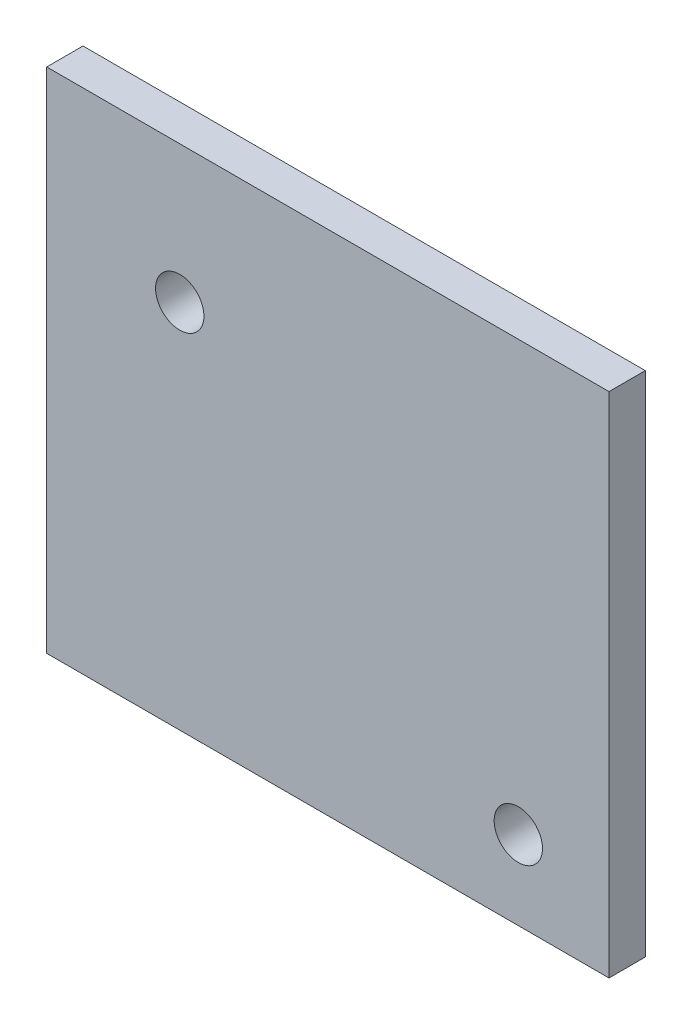
ISO-10303-21;
HEADER;
FILE_DESCRIPTION(('STEP AP214'),'2;1');
FILE_NAME('part.step','',(''),(''),'','','');
FILE_SCHEMA(('AUTOMOTIVE_DESIGN { 1 0 10303 214 1 1 1 1 }'));
ENDSEC;
DATA;
#1=APPLICATION_CONTEXT('core data for automotive mechanical design processes');
#2=APPLICATION_PROTOCOL_DEFINITION('international standard','automotive_design',2000,#1);
#3=PRODUCT_CONTEXT('',#1,'mechanical');
#4=PRODUCT('Part','Part','',(#3));
#5=PRODUCT_RELATED_PRODUCT_CATEGORY('part','',(#4));
#6=PRODUCT_DEFINITION_FORMATION('','',#4);
#7=PRODUCT_DEFINITION_CONTEXT('part definition',#1,'design');
#8=PRODUCT_DEFINITION('design','',#6,#7);
#9=PRODUCT_DEFINITION_SHAPE('','',#8);
#10=(LENGTH_UNIT() NAMED_UNIT(*) SI_UNIT(.MILLI.,.METRE.));
#11=(NAMED_UNIT(*) PLANE_ANGLE_UNIT() SI_UNIT($,.RADIAN.));
#12=(NAMED_UNIT(*) SI_UNIT($,.STERADIAN.) SOLID_ANGLE_UNIT());
#13=UNCERTAINTY_MEASURE_WITH_UNIT(LENGTH_MEASURE(1.E-05),#10,'distance_accuracy_value','');
#14=(GEOMETRIC_REPRESENTATION_CONTEXT(3) GLOBAL_UNCERTAINTY_ASSIGNED_CONTEXT((#13)) GLOBAL_UNIT_ASSIGNED_CONTEXT((#10,
#11,#12)) REPRESENTATION_CONTEXT('',''));
#15=CARTESIAN_POINT('',(0.,0.,0.));
#16=DIRECTION('',(0.,0.,1.));
#17=DIRECTION('',(1.,0.,0.));
#18=AXIS2_PLACEMENT_3D('',#15,#16,#17);
#19=CARTESIAN_POINT('',(0.,0.,3.));
#20=DIRECTION('',(0.,0.,1.));
#21=DIRECTION('',(1.,0.,0.));
#22=AXIS2_PLACEMENT_3D('',#19,#20,#21);
#23=PLANE('',#22);
#24=CARTESIAN_POINT('',(-10.6859808721311,9.55554613060466,3.));
#25=DIRECTION('',(0.,0.,1.));
#26=DIRECTION('',(1.,0.,0.));
#27=AXIS2_PLACEMENT_3D('',#24,#25,#26);
#28=CIRCLE('',#27,2.);
#29=CARTESIAN_POINT('',(-8.68598087213109,9.55554613060466,3.));
#30=VERTEX_POINT('',#29);
#31=EDGE_CURVE('E100',#30,#30,#28,.T.);
#32=ORIENTED_EDGE('',*,*,#31,.F.);
#33=EDGE_LOOP('',(#32));
#34=FACE_BOUND('',#33,.T.);
#35=DIRECTION('',(0.,-1.,0.));
#36=VECTOR('',#35,1.);
#37=CARTESIAN_POINT('',(-21.6859808721304,20.9070095638266,3.));
#38=LINE('',#37,#36);
#39=CARTESIAN_POINT('',(-21.6859808721304,20.9070095638266,3.));
#40=VERTEX_POINT('',#39);
#41=CARTESIAN_POINT('',(-21.6859808721304,-21.0929904361686,3.));
#42=VERTEX_POINT('',#41);
#43=EDGE_CURVE('E85',#40,#42,#38,.T.);
#44=ORIENTED_EDGE('',*,*,#43,.T.);
#45=DIRECTION('',(1.,0.,0.));
#46=VECTOR('',#45,1.);
#47=CARTESIAN_POINT('',(-21.6859808721304,-21.0929904361686,3.));
#48=LINE('',#47,#46);
#49=CARTESIAN_POINT('',(24.8140191278703,-21.0929904361686,3.));
#50=VERTEX_POINT('',#49);
#51=EDGE_CURVE('E80',#42,#50,#48,.T.);
#52=ORIENTED_EDGE('',*,*,#51,.T.);
#53=DIRECTION('',(0.,1.,0.));
#54=VECTOR('',#53,1.);
#55=CARTESIAN_POINT('',(24.8140191278703,20.9070095638266,3.));
#56=LINE('',#55,#54);
#57=CARTESIAN_POINT('',(24.8140191278703,20.9070095638266,3.));
#58=VERTEX_POINT('',#57);
#59=EDGE_CURVE('E83',#50,#58,#56,.T.);
#60=ORIENTED_EDGE('',*,*,#59,.T.);
#61=DIRECTION('',(-1.,0.,0.));
#62=VECTOR('',#61,1.);
#63=CARTESIAN_POINT('',(-21.6859808721304,20.9070095638266,3.));
#64=LINE('',#63,#62);
#65=EDGE_CURVE('E50',#58,#40,#64,.T.);
#66=ORIENTED_EDGE('',*,*,#65,.T.);
#67=EDGE_LOOP('',(#44,#52,#60,#66));
#68=FACE_BOUND('',#67,.T.);
#69=CARTESIAN_POINT('',(17.3140191278689,-14.5728724512838,3.));
#70=DIRECTION('',(0.,0.,1.));
#71=DIRECTION('',(1.,0.,0.));
#72=AXIS2_PLACEMENT_3D('',#69,#70,#71);
#73=CIRCLE('',#72,2.);
#74=CARTESIAN_POINT('',(19.3140191278689,-14.5728724512838,3.));
#75=VERTEX_POINT('',#74);
#76=EDGE_CURVE('E115',#75,#75,#73,.T.);
#77=ORIENTED_EDGE('',*,*,#76,.F.);
#78=EDGE_LOOP('',(#77));
#79=FACE_BOUND('',#78,.T.);
#80=ADVANCED_FACE('F33',(#34,#68,#79),#23,.T.);
#81=CARTESIAN_POINT('',(0.,0.,0.));
#82=DIRECTION('',(0.,0.,1.));
#83=DIRECTION('',(1.,0.,0.));
#84=AXIS2_PLACEMENT_3D('',#81,#82,#83);
#85=PLANE('',#84);
#86=DIRECTION('',(0.,-1.,0.));
#87=VECTOR('',#86,1.);
#88=CARTESIAN_POINT('',(-21.6859808721304,20.9070095638266,0.));
#89=LINE('',#88,#87);
#90=CARTESIAN_POINT('',(-21.6859808721304,20.9070095638266,0.));
#91=VERTEX_POINT('',#90);
#92=CARTESIAN_POINT('',(-21.6859808721304,-21.0929904361686,0.));
#93=VERTEX_POINT('',#92);
#94=EDGE_CURVE('E97',#91,#93,#89,.T.);
#95=ORIENTED_EDGE('',*,*,#94,.F.);
#96=DIRECTION('',(-1.,0.,0.));
#97=VECTOR('',#96,1.);
#98=CARTESIAN_POINT('',(-21.6859808721304,20.9070095638266,0.));
#99=LINE('',#98,#97);
#100=CARTESIAN_POINT('',(24.8140191278703,20.9070095638266,0.));
#101=VERTEX_POINT('',#100);
#102=EDGE_CURVE('E73',#101,#91,#99,.T.);
#103=ORIENTED_EDGE('',*,*,#102,.F.);
#104=DIRECTION('',(0.,1.,0.));
#105=VECTOR('',#104,1.);
#106=CARTESIAN_POINT('',(24.8140191278703,20.9070095638266,0.));
#107=LINE('',#106,#105);
#108=CARTESIAN_POINT('',(24.8140191278703,-21.0929904361686,0.));
#109=VERTEX_POINT('',#108);
#110=EDGE_CURVE('E67',#109,#101,#107,.T.);
#111=ORIENTED_EDGE('',*,*,#110,.F.);
#112=DIRECTION('',(1.,0.,0.));
#113=VECTOR('',#112,1.);
#114=CARTESIAN_POINT('',(-21.6859808721304,-21.0929904361686,0.));
#115=LINE('',#114,#113);
#116=EDGE_CURVE('E89',#93,#109,#115,.T.);
#117=ORIENTED_EDGE('',*,*,#116,.F.);
#118=EDGE_LOOP('',(#95,#103,#111,#117));
#119=FACE_BOUND('',#118,.T.);
#120=CARTESIAN_POINT('',(-10.6859808721311,9.55554613060466,0.));
#121=DIRECTION('',(0.,0.,1.));
#122=DIRECTION('',(1.,0.,0.));
#123=AXIS2_PLACEMENT_3D('',#120,#121,#122);
#124=CIRCLE('',#123,2.);
#125=CARTESIAN_POINT('',(-8.68598087213109,9.55554613060466,0.));
#126=VERTEX_POINT('',#125);
#127=EDGE_CURVE('E112',#126,#126,#124,.T.);
#128=ORIENTED_EDGE('',*,*,#127,.T.);
#129=EDGE_LOOP('',(#128));
#130=FACE_BOUND('',#129,.T.);
#131=CARTESIAN_POINT('',(17.3140191278689,-14.5728724512838,0.));
#132=DIRECTION('',(0.,0.,1.));
#133=DIRECTION('',(1.,0.,0.));
#134=AXIS2_PLACEMENT_3D('',#131,#132,#133);
#135=CIRCLE('',#134,2.);
#136=CARTESIAN_POINT('',(19.3140191278689,-14.5728724512838,0.));
#137=VERTEX_POINT('',#136);
#138=EDGE_CURVE('E118',#137,#137,#135,.T.);
#139=ORIENTED_EDGE('',*,*,#138,.T.);
#140=EDGE_LOOP('',(#139));
#141=FACE_BOUND('',#140,.T.);
#142=ADVANCED_FACE('F108',(#119,#130,#141),#85,.F.);
#143=CARTESIAN_POINT('',(-21.6859808721304,20.9070095638266,3.));
#144=DIRECTION('',(1.,0.,0.));
#145=DIRECTION('',(0.,0.,-1.));
#146=AXIS2_PLACEMENT_3D('',#143,#144,#145);
#147=PLANE('',#146);
#148=ORIENTED_EDGE('',*,*,#94,.T.);
#149=DIRECTION('',(0.,0.,-1.));
#150=VECTOR('',#149,1.);
#151=CARTESIAN_POINT('',(-21.6859808721304,-21.0929904361686,3.));
#152=LINE('',#151,#150);
#153=EDGE_CURVE('E11',#42,#93,#152,.T.);
#154=ORIENTED_EDGE('',*,*,#153,.F.);
#155=ORIENTED_EDGE('',*,*,#43,.F.);
#156=DIRECTION('',(0.,0.,-1.));
#157=VECTOR('',#156,1.);
#158=CARTESIAN_POINT('',(-21.6859808721304,20.9070095638266,3.));
#159=LINE('',#158,#157);
#160=EDGE_CURVE('E93',#40,#91,#159,.T.);
#161=ORIENTED_EDGE('',*,*,#160,.T.);
#162=EDGE_LOOP('',(#148,#154,#155,#161));
#163=FACE_BOUND('',#162,.T.);
#164=ADVANCED_FACE('F35',(#163),#147,.F.);
#165=CARTESIAN_POINT('',(-21.6859808721304,-21.0929904361686,3.));
#166=DIRECTION('',(0.,1.,0.));
#167=DIRECTION('',(0.,0.,1.));
#168=AXIS2_PLACEMENT_3D('',#165,#166,#167);
#169=PLANE('',#168);
#170=ORIENTED_EDGE('',*,*,#116,.T.);
#171=DIRECTION('',(0.,0.,-1.));
#172=VECTOR('',#171,1.);
#173=CARTESIAN_POINT('',(24.8140191278703,-21.0929904361686,3.));
#174=LINE('',#173,#172);
#175=EDGE_CURVE('E42',#50,#109,#174,.T.);
#176=ORIENTED_EDGE('',*,*,#175,.F.);
#177=ORIENTED_EDGE('',*,*,#51,.F.);
#178=ORIENTED_EDGE('',*,*,#153,.T.);
#179=EDGE_LOOP('',(#170,#176,#177,#178));
#180=FACE_BOUND('',#179,.T.);
#181=ADVANCED_FACE('F88',(#180),#169,.F.);
#182=CARTESIAN_POINT('',(24.8140191278703,20.9070095638266,3.));
#183=DIRECTION('',(-1.,0.,0.));
#184=DIRECTION('',(0.,-1.,0.));
#185=AXIS2_PLACEMENT_3D('',#182,#183,#184);
#186=PLANE('',#185);
#187=ORIENTED_EDGE('',*,*,#110,.T.);
#188=DIRECTION('',(0.,0.,-1.));
#189=VECTOR('',#188,1.);
#190=CARTESIAN_POINT('',(24.8140191278703,20.9070095638266,3.));
#191=LINE('',#190,#189);
#192=EDGE_CURVE('E90',#58,#101,#191,.T.);
#193=ORIENTED_EDGE('',*,*,#192,.F.);
#194=ORIENTED_EDGE('',*,*,#59,.F.);
#195=ORIENTED_EDGE('',*,*,#175,.T.);
#196=EDGE_LOOP('',(#187,#193,#194,#195));
#197=FACE_BOUND('',#196,.T.);
#198=ADVANCED_FACE('F91',(#197),#186,.F.);
#199=CARTESIAN_POINT('',(-21.6859808721304,20.9070095638266,3.));
#200=DIRECTION('',(0.,-1.,0.));
#201=DIRECTION('',(0.,0.,-1.));
#202=AXIS2_PLACEMENT_3D('',#199,#200,#201);
#203=PLANE('',#202);
#204=ORIENTED_EDGE('',*,*,#102,.T.);
#205=ORIENTED_EDGE('',*,*,#160,.F.);
#206=ORIENTED_EDGE('',*,*,#65,.F.);
#207=ORIENTED_EDGE('',*,*,#192,.T.);
#208=EDGE_LOOP('',(#204,#205,#206,#207));
#209=FACE_BOUND('',#208,.T.);
#210=ADVANCED_FACE('F105',(#209),#203,.F.);
#211=CARTESIAN_POINT('',(-10.6859808721311,9.55554613060466,3.));
#212=DIRECTION('',(0.,0.,-1.));
#213=DIRECTION('',(-1.,0.,0.));
#214=AXIS2_PLACEMENT_3D('',#211,#212,#213);
#215=CYLINDRICAL_SURFACE('',#214,2.);
#216=ORIENTED_EDGE('',*,*,#31,.T.);
#217=EDGE_LOOP('',(#216));
#218=FACE_BOUND('',#217,.T.);
#219=ORIENTED_EDGE('',*,*,#127,.F.);
#220=EDGE_LOOP('',(#219));
#221=FACE_BOUND('',#220,.T.);
#222=ADVANCED_FACE('F135',(#218,#221),#215,.F.);
#223=CARTESIAN_POINT('',(17.3140191278689,-14.5728724512838,3.));
#224=DIRECTION('',(0.,0.,-1.));
#225=DIRECTION('',(-1.,0.,0.));
#226=AXIS2_PLACEMENT_3D('',#223,#224,#225);
#227=CYLINDRICAL_SURFACE('',#226,2.);
#228=ORIENTED_EDGE('',*,*,#76,.T.);
#229=EDGE_LOOP('',(#228));
#230=FACE_BOUND('',#229,.T.);
#231=ORIENTED_EDGE('',*,*,#138,.F.);
#232=EDGE_LOOP('',(#231));
#233=FACE_BOUND('',#232,.T.);
#234=ADVANCED_FACE('F124',(#230,#233),#227,.F.);
#235=CLOSED_SHELL('',(#80,#142,#164,#181,#198,#210,#222,#234));
#236=MANIFOLD_SOLID_BREP('B2',#235);
#237=ADVANCED_BREP_SHAPE_REPRESENTATION('',(#18,#236),#14);
#238=SHAPE_DEFINITION_REPRESENTATION(#9,#237);
ENDSEC;
END-ISO-10303-21;
